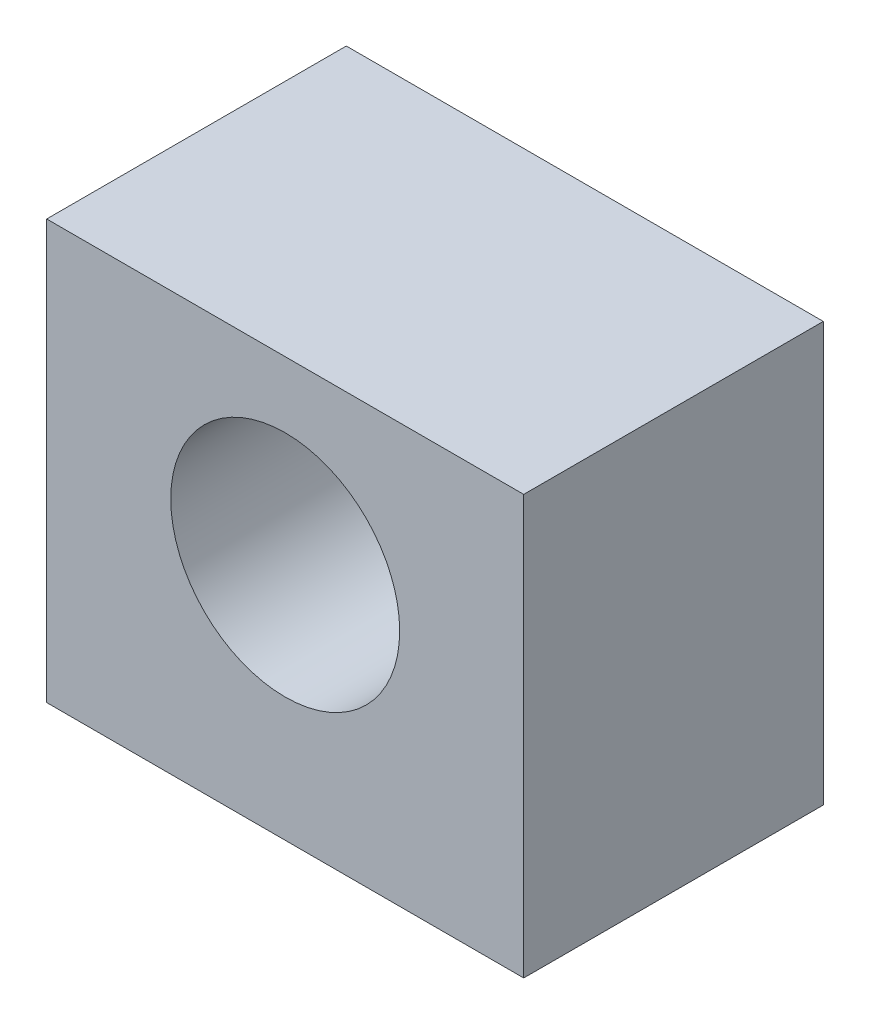
ISO-10303-21;
HEADER;
FILE_DESCRIPTION(('STEP AP214'),'2;1');
FILE_NAME('part.step','',(''),(''),'','','');
FILE_SCHEMA(('AUTOMOTIVE_DESIGN { 1 0 10303 214 1 1 1 1 }'));
ENDSEC;
DATA;
#1=APPLICATION_CONTEXT('core data for automotive mechanical design processes');
#2=APPLICATION_PROTOCOL_DEFINITION('international standard','automotive_design',2000,#1);
#3=PRODUCT_CONTEXT('',#1,'mechanical');
#4=PRODUCT('Part','Part','',(#3));
#5=PRODUCT_RELATED_PRODUCT_CATEGORY('part','',(#4));
#6=PRODUCT_DEFINITION_FORMATION('','',#4);
#7=PRODUCT_DEFINITION_CONTEXT('part definition',#1,'design');
#8=PRODUCT_DEFINITION('design','',#6,#7);
#9=PRODUCT_DEFINITION_SHAPE('','',#8);
#10=(LENGTH_UNIT() NAMED_UNIT(*) SI_UNIT(.MILLI.,.METRE.));
#11=(NAMED_UNIT(*) PLANE_ANGLE_UNIT() SI_UNIT($,.RADIAN.));
#12=(NAMED_UNIT(*) SI_UNIT($,.STERADIAN.) SOLID_ANGLE_UNIT());
#13=UNCERTAINTY_MEASURE_WITH_UNIT(LENGTH_MEASURE(1.E-05),#10,'distance_accuracy_value','');
#14=(GEOMETRIC_REPRESENTATION_CONTEXT(3) GLOBAL_UNCERTAINTY_ASSIGNED_CONTEXT((#13)) GLOBAL_UNIT_ASSIGNED_CONTEXT((#10,
#11,#12)) REPRESENTATION_CONTEXT('',''));
#15=CARTESIAN_POINT('',(0.,0.,0.));
#16=DIRECTION('',(0.,0.,1.));
#17=DIRECTION('',(1.,0.,0.));
#18=AXIS2_PLACEMENT_3D('',#15,#16,#17);
#19=CARTESIAN_POINT('',(-0.1,7.1,5.15));
#20=DIRECTION('',(1.,0.,0.));
#21=DIRECTION('',(0.,0.,-1.));
#22=AXIS2_PLACEMENT_3D('',#19,#20,#21);
#23=PLANE('',#22);
#24=DIRECTION('',(0.,-1.,0.));
#25=VECTOR('',#24,1.);
#26=CARTESIAN_POINT('',(-0.1,7.1,0.));
#27=LINE('',#26,#25);
#28=CARTESIAN_POINT('',(-0.1,7.1,0.));
#29=VERTEX_POINT('',#28);
#30=CARTESIAN_POINT('',(-0.1,-0.1,0.));
#31=VERTEX_POINT('',#30);
#32=EDGE_CURVE('E96',#29,#31,#27,.T.);
#33=ORIENTED_EDGE('',*,*,#32,.T.);
#34=DIRECTION('',(0.,0.,-1.));
#35=VECTOR('',#34,1.);
#36=CARTESIAN_POINT('',(-0.1,-0.1,5.15));
#37=LINE('',#36,#35);
#38=CARTESIAN_POINT('',(-0.1,-0.1,5.15));
#39=VERTEX_POINT('',#38);
#40=EDGE_CURVE('E11',#39,#31,#37,.T.);
#41=ORIENTED_EDGE('',*,*,#40,.F.);
#42=DIRECTION('',(0.,-1.,0.));
#43=VECTOR('',#42,1.);
#44=CARTESIAN_POINT('',(-0.1,7.1,5.15));
#45=LINE('',#44,#43);
#46=CARTESIAN_POINT('',(-0.1,7.1,5.15));
#47=VERTEX_POINT('',#46);
#48=EDGE_CURVE('E84',#47,#39,#45,.T.);
#49=ORIENTED_EDGE('',*,*,#48,.F.);
#50=DIRECTION('',(0.,0.,-1.));
#51=VECTOR('',#50,1.);
#52=CARTESIAN_POINT('',(-0.1,7.1,5.15));
#53=LINE('',#52,#51);
#54=EDGE_CURVE('E92',#47,#29,#53,.T.);
#55=ORIENTED_EDGE('',*,*,#54,.T.);
#56=EDGE_LOOP('',(#33,#41,#49,#55));
#57=FACE_BOUND('',#56,.T.);
#58=ADVANCED_FACE('F33',(#57),#23,.F.);
#59=CARTESIAN_POINT('',(7.,-0.1,5.15));
#60=DIRECTION('',(0.,1.,0.));
#61=DIRECTION('',(0.,0.,1.));
#62=AXIS2_PLACEMENT_3D('',#59,#60,#61);
#63=PLANE('',#62);
#64=DIRECTION('',(1.,0.,0.));
#65=VECTOR('',#64,1.);
#66=CARTESIAN_POINT('',(7.,-0.1,0.));
#67=LINE('',#66,#65);
#68=CARTESIAN_POINT('',(8.1,-0.1,0.));
#69=VERTEX_POINT('',#68);
#70=EDGE_CURVE('E88',#31,#69,#67,.T.);
#71=ORIENTED_EDGE('',*,*,#70,.T.);
#72=DIRECTION('',(0.,0.,-1.));
#73=VECTOR('',#72,1.);
#74=CARTESIAN_POINT('',(8.1,-0.1,5.15));
#75=LINE('',#74,#73);
#76=CARTESIAN_POINT('',(8.1,-0.1,5.15));
#77=VERTEX_POINT('',#76);
#78=EDGE_CURVE('E41',#77,#69,#75,.T.);
#79=ORIENTED_EDGE('',*,*,#78,.F.);
#80=DIRECTION('',(1.,0.,0.));
#81=VECTOR('',#80,1.);
#82=CARTESIAN_POINT('',(-0.1,-0.1,5.15));
#83=LINE('',#82,#81);
#84=EDGE_CURVE('E79',#39,#77,#83,.T.);
#85=ORIENTED_EDGE('',*,*,#84,.F.);
#86=ORIENTED_EDGE('',*,*,#40,.T.);
#87=EDGE_LOOP('',(#71,#79,#85,#86));
#88=FACE_BOUND('',#87,.T.);
#89=ADVANCED_FACE('F87',(#88),#63,.F.);
#90=CARTESIAN_POINT('',(8.1,-0.1,5.15));
#91=DIRECTION('',(-1.,0.,0.));
#92=DIRECTION('',(0.,0.,1.));
#93=AXIS2_PLACEMENT_3D('',#90,#91,#92);
#94=PLANE('',#93);
#95=DIRECTION('',(0.,1.,0.));
#96=VECTOR('',#95,1.);
#97=CARTESIAN_POINT('',(8.1,-0.1,0.));
#98=LINE('',#97,#96);
#99=CARTESIAN_POINT('',(8.1,7.1,0.));
#100=VERTEX_POINT('',#99);
#101=EDGE_CURVE('E66',#69,#100,#98,.T.);
#102=ORIENTED_EDGE('',*,*,#101,.T.);
#103=DIRECTION('',(0.,0.,-1.));
#104=VECTOR('',#103,1.);
#105=CARTESIAN_POINT('',(8.1,7.1,5.15));
#106=LINE('',#105,#104);
#107=CARTESIAN_POINT('',(8.1,7.1,5.15));
#108=VERTEX_POINT('',#107);
#109=EDGE_CURVE('E89',#108,#100,#106,.T.);
#110=ORIENTED_EDGE('',*,*,#109,.F.);
#111=DIRECTION('',(0.,1.,0.));
#112=VECTOR('',#111,1.);
#113=CARTESIAN_POINT('',(8.1,-0.1,5.15));
#114=LINE('',#113,#112);
#115=EDGE_CURVE('E82',#77,#108,#114,.T.);
#116=ORIENTED_EDGE('',*,*,#115,.F.);
#117=ORIENTED_EDGE('',*,*,#78,.T.);
#118=EDGE_LOOP('',(#102,#110,#116,#117));
#119=FACE_BOUND('',#118,.T.);
#120=ADVANCED_FACE('F90',(#119),#94,.F.);
#121=CARTESIAN_POINT('',(8.1,7.1,5.15));
#122=DIRECTION('',(0.,-1.,0.));
#123=DIRECTION('',(0.,0.,-1.));
#124=AXIS2_PLACEMENT_3D('',#121,#122,#123);
#125=PLANE('',#124);
#126=DIRECTION('',(-1.,0.,0.));
#127=VECTOR('',#126,1.);
#128=CARTESIAN_POINT('',(8.1,7.1,0.));
#129=LINE('',#128,#127);
#130=EDGE_CURVE('E72',#100,#29,#129,.T.);
#131=ORIENTED_EDGE('',*,*,#130,.T.);
#132=ORIENTED_EDGE('',*,*,#54,.F.);
#133=DIRECTION('',(-1.,0.,0.));
#134=VECTOR('',#133,1.);
#135=CARTESIAN_POINT('',(8.1,7.1,5.15));
#136=LINE('',#135,#134);
#137=EDGE_CURVE('E49',#108,#47,#136,.T.);
#138=ORIENTED_EDGE('',*,*,#137,.F.);
#139=ORIENTED_EDGE('',*,*,#109,.T.);
#140=EDGE_LOOP('',(#131,#132,#138,#139));
#141=FACE_BOUND('',#140,.T.);
#142=ADVANCED_FACE('F104',(#141),#125,.F.);
#143=CARTESIAN_POINT('',(-0.1,-0.1,5.15));
#144=DIRECTION('',(0.,0.,1.));
#145=DIRECTION('',(1.,0.,0.));
#146=AXIS2_PLACEMENT_3D('',#143,#144,#145);
#147=PLANE('',#146);
#148=CARTESIAN_POINT('',(4.,4.,5.15));
#149=DIRECTION('',(0.,0.,1.));
#150=DIRECTION('',(1.,0.,0.));
#151=AXIS2_PLACEMENT_3D('',#148,#149,#150);
#152=CIRCLE('',#151,1.9675);
#153=CARTESIAN_POINT('',(5.9675,4.,5.15));
#154=VERTEX_POINT('',#153);
#155=EDGE_CURVE('E110',#154,#154,#152,.T.);
#156=ORIENTED_EDGE('',*,*,#155,.F.);
#157=EDGE_LOOP('',(#156));
#158=FACE_BOUND('',#157,.T.);
#159=ORIENTED_EDGE('',*,*,#48,.T.);
#160=ORIENTED_EDGE('',*,*,#84,.T.);
#161=ORIENTED_EDGE('',*,*,#115,.T.);
#162=ORIENTED_EDGE('',*,*,#137,.T.);
#163=EDGE_LOOP('',(#159,#160,#161,#162));
#164=FACE_BOUND('',#163,.T.);
#165=ADVANCED_FACE('F80',(#158,#164),#147,.T.);
#166=CARTESIAN_POINT('',(-0.1,-0.1,0.));
#167=DIRECTION('',(0.,0.,1.));
#168=DIRECTION('',(1.,0.,0.));
#169=AXIS2_PLACEMENT_3D('',#166,#167,#168);
#170=PLANE('',#169);
#171=CARTESIAN_POINT('',(4.,4.,0.));
#172=DIRECTION('',(0.,0.,1.));
#173=DIRECTION('',(1.,0.,0.));
#174=AXIS2_PLACEMENT_3D('',#171,#172,#173);
#175=CIRCLE('',#174,1.9675);
#176=CARTESIAN_POINT('',(5.9675,4.,0.));
#177=VERTEX_POINT('',#176);
#178=EDGE_CURVE('E99',#177,#177,#175,.T.);
#179=ORIENTED_EDGE('',*,*,#178,.T.);
#180=EDGE_LOOP('',(#179));
#181=FACE_BOUND('',#180,.T.);
#182=ORIENTED_EDGE('',*,*,#32,.F.);
#183=ORIENTED_EDGE('',*,*,#130,.F.);
#184=ORIENTED_EDGE('',*,*,#101,.F.);
#185=ORIENTED_EDGE('',*,*,#70,.F.);
#186=EDGE_LOOP('',(#182,#183,#184,#185));
#187=FACE_BOUND('',#186,.T.);
#188=ADVANCED_FACE('F107',(#181,#187),#170,.F.);
#189=CARTESIAN_POINT('',(4.,4.,0.));
#190=DIRECTION('',(0.,0.,1.));
#191=DIRECTION('',(1.,0.,0.));
#192=AXIS2_PLACEMENT_3D('',#189,#190,#191);
#193=CYLINDRICAL_SURFACE('',#192,1.9675);
#194=ORIENTED_EDGE('',*,*,#178,.F.);
#195=EDGE_LOOP('',(#194));
#196=FACE_BOUND('',#195,.T.);
#197=ORIENTED_EDGE('',*,*,#155,.T.);
#198=EDGE_LOOP('',(#197));
#199=FACE_BOUND('',#198,.T.);
#200=ADVANCED_FACE('F117',(#196,#199),#193,.F.);
#201=CLOSED_SHELL('',(#58,#89,#120,#142,#165,#188,#200));
#202=MANIFOLD_SOLID_BREP('B2',#201);
#203=ADVANCED_BREP_SHAPE_REPRESENTATION('',(#18,#202),#14);
#204=SHAPE_DEFINITION_REPRESENTATION(#9,#203);
ENDSEC;
END-ISO-10303-21;
